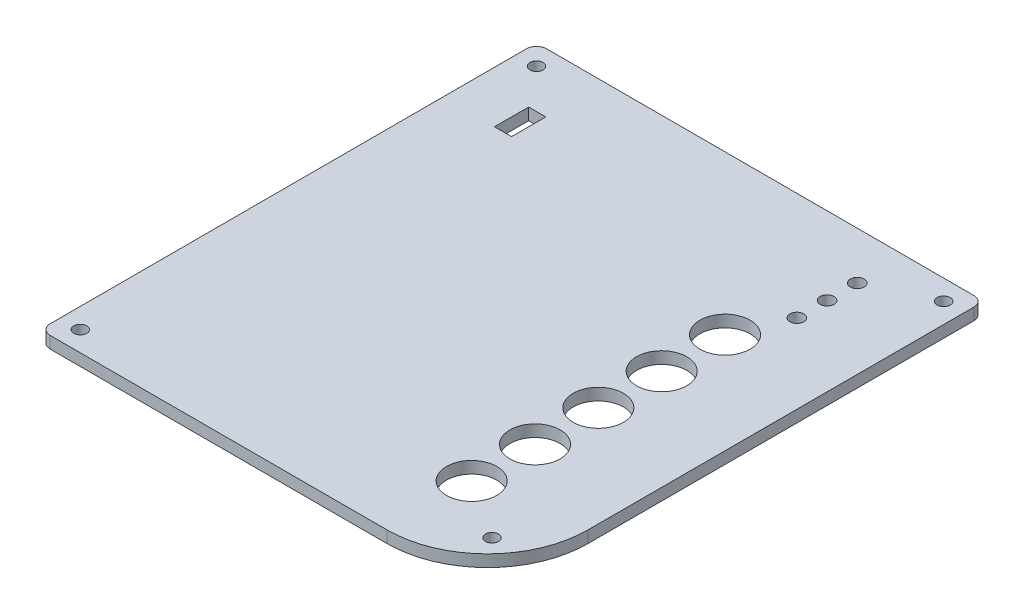
ISO-10303-21;
HEADER;
FILE_DESCRIPTION(('STEP AP214'),'2;1');
FILE_NAME('part.step','',(''),(''),'','','');
FILE_SCHEMA(('AUTOMOTIVE_DESIGN { 1 0 10303 214 1 1 1 1 }'));
ENDSEC;
DATA;
#1=APPLICATION_CONTEXT('core data for automotive mechanical design processes');
#2=APPLICATION_PROTOCOL_DEFINITION('international standard','automotive_design',2000,#1);
#3=PRODUCT_CONTEXT('',#1,'mechanical');
#4=PRODUCT('Part','Part','',(#3));
#5=PRODUCT_RELATED_PRODUCT_CATEGORY('part','',(#4));
#6=PRODUCT_DEFINITION_FORMATION('','',#4);
#7=PRODUCT_DEFINITION_CONTEXT('part definition',#1,'design');
#8=PRODUCT_DEFINITION('design','',#6,#7);
#9=PRODUCT_DEFINITION_SHAPE('','',#8);
#10=(LENGTH_UNIT() NAMED_UNIT(*) SI_UNIT(.MILLI.,.METRE.));
#11=(NAMED_UNIT(*) PLANE_ANGLE_UNIT() SI_UNIT($,.RADIAN.));
#12=(NAMED_UNIT(*) SI_UNIT($,.STERADIAN.) SOLID_ANGLE_UNIT());
#13=UNCERTAINTY_MEASURE_WITH_UNIT(LENGTH_MEASURE(1.E-05),#10,'distance_accuracy_value','');
#14=(GEOMETRIC_REPRESENTATION_CONTEXT(3) GLOBAL_UNCERTAINTY_ASSIGNED_CONTEXT((#13)) GLOBAL_UNIT_ASSIGNED_CONTEXT((#10,
#11,#12)) REPRESENTATION_CONTEXT('',''));
#15=CARTESIAN_POINT('',(0.,0.,0.));
#16=DIRECTION('',(0.,0.,1.));
#17=DIRECTION('',(1.,0.,0.));
#18=AXIS2_PLACEMENT_3D('',#15,#16,#17);
#19=CARTESIAN_POINT('',(22.8844907346791,3.,46.8900761871675));
#20=DIRECTION('',(0.,1.,0.));
#21=DIRECTION('',(0.,0.,1.));
#22=AXIS2_PLACEMENT_3D('',#19,#20,#21);
#23=PLANE('',#22);
#24=DIRECTION('',(0.,0.,1.));
#25=VECTOR('',#24,1.);
#26=CARTESIAN_POINT('',(-51.7155092653209,3.,-38.1099778128325));
#27=LINE('',#26,#25);
#28=CARTESIAN_POINT('',(-51.7155092653209,3.,-38.1099778128325));
#29=VERTEX_POINT('',#28);
#30=CARTESIAN_POINT('',(-51.7155092653209,3.,-29.4739778128325));
#31=VERTEX_POINT('',#30);
#32=EDGE_CURVE('E47',#29,#31,#27,.T.);
#33=ORIENTED_EDGE('',*,*,#32,.F.);
#34=DIRECTION('',(-1.,0.,0.));
#35=VECTOR('',#34,1.);
#36=CARTESIAN_POINT('',(-51.7155092653209,3.,-38.1099778128325));
#37=LINE('',#36,#35);
#38=CARTESIAN_POINT('',(-47.3975092653209,3.,-38.1099778128325));
#39=VERTEX_POINT('',#38);
#40=EDGE_CURVE('E139',#39,#29,#37,.T.);
#41=ORIENTED_EDGE('',*,*,#40,.F.);
#42=DIRECTION('',(0.,0.,-1.));
#43=VECTOR('',#42,1.);
#44=CARTESIAN_POINT('',(-47.3975092653209,3.,-38.1099778128325));
#45=LINE('',#44,#43);
#46=CARTESIAN_POINT('',(-47.3975092653209,3.,-29.4739778128325));
#47=VERTEX_POINT('',#46);
#48=EDGE_CURVE('E142',#47,#39,#45,.T.);
#49=ORIENTED_EDGE('',*,*,#48,.F.);
#50=DIRECTION('',(1.,0.,0.));
#51=VECTOR('',#50,1.);
#52=CARTESIAN_POINT('',(-51.7155092653209,3.,-29.4739778128325));
#53=LINE('',#52,#51);
#54=EDGE_CURVE('E148',#31,#47,#53,.T.);
#55=ORIENTED_EDGE('',*,*,#54,.F.);
#56=EDGE_LOOP('',(#33,#41,#49,#55));
#57=FACE_BOUND('',#56,.T.);
#58=CARTESIAN_POINT('',(28.2844907346793,3.,-25.8699778128325));
#59=DIRECTION('',(0.,1.,0.));
#60=DIRECTION('',(0.,0.,1.));
#61=AXIS2_PLACEMENT_3D('',#58,#59,#60);
#62=CIRCLE('',#61,1.75);
#63=CARTESIAN_POINT('',(28.2844907346793,3.,-24.1199778128325));
#64=VERTEX_POINT('',#63);
#65=EDGE_CURVE('E154',#64,#64,#62,.T.);
#66=ORIENTED_EDGE('',*,*,#65,.F.);
#67=EDGE_LOOP('',(#66));
#68=FACE_BOUND('',#67,.T.);
#69=CARTESIAN_POINT('',(28.2844907346792,3.,-33.4899778128325));
#70=DIRECTION('',(0.,1.,0.));
#71=DIRECTION('',(0.,0.,1.));
#72=AXIS2_PLACEMENT_3D('',#69,#70,#71);
#73=CIRCLE('',#72,1.75);
#74=CARTESIAN_POINT('',(28.2844907346792,3.,-31.7399778128325));
#75=VERTEX_POINT('',#74);
#76=EDGE_CURVE('E161',#75,#75,#73,.T.);
#77=ORIENTED_EDGE('',*,*,#76,.F.);
#78=EDGE_LOOP('',(#77));
#79=FACE_BOUND('',#78,.T.);
#80=CARTESIAN_POINT('',(28.2844907346791,3.,-41.1099778128325));
#81=DIRECTION('',(0.,1.,0.));
#82=DIRECTION('',(0.,0.,1.));
#83=AXIS2_PLACEMENT_3D('',#80,#81,#82);
#84=CIRCLE('',#83,1.75);
#85=CARTESIAN_POINT('',(28.2844907346791,3.,-39.3599778128325));
#86=VERTEX_POINT('',#85);
#87=EDGE_CURVE('E167',#86,#86,#84,.T.);
#88=ORIENTED_EDGE('',*,*,#87,.F.);
#89=EDGE_LOOP('',(#88));
#90=FACE_BOUND('',#89,.T.);
#91=CARTESIAN_POINT('',(22.8844907346798,3.,50.8900221871675));
#92=DIRECTION('',(0.,1.,0.));
#93=DIRECTION('',(0.,0.,1.));
#94=AXIS2_PLACEMENT_3D('',#91,#92,#93);
#95=CIRCLE('',#94,6.35);
#96=CARTESIAN_POINT('',(22.8844907346798,3.,57.2400221871675));
#97=VERTEX_POINT('',#96);
#98=EDGE_CURVE('E173',#97,#97,#95,.T.);
#99=ORIENTED_EDGE('',*,*,#98,.F.);
#100=EDGE_LOOP('',(#99));
#101=FACE_BOUND('',#100,.T.);
#102=CARTESIAN_POINT('',(22.8844907346796,3.,34.8900221871675));
#103=DIRECTION('',(0.,1.,0.));
#104=DIRECTION('',(0.,0.,1.));
#105=AXIS2_PLACEMENT_3D('',#102,#103,#104);
#106=CIRCLE('',#105,6.35);
#107=CARTESIAN_POINT('',(22.8844907346796,3.,41.2400221871675));
#108=VERTEX_POINT('',#107);
#109=EDGE_CURVE('E179',#108,#108,#106,.T.);
#110=ORIENTED_EDGE('',*,*,#109,.F.);
#111=EDGE_LOOP('',(#110));
#112=FACE_BOUND('',#111,.T.);
#113=CARTESIAN_POINT('',(22.8844907346794,3.,18.8900221871675));
#114=DIRECTION('',(0.,1.,0.));
#115=DIRECTION('',(0.,0.,1.));
#116=AXIS2_PLACEMENT_3D('',#113,#114,#115);
#117=CIRCLE('',#116,6.35);
#118=CARTESIAN_POINT('',(22.8844907346794,3.,25.2400221871675));
#119=VERTEX_POINT('',#118);
#120=EDGE_CURVE('E185',#119,#119,#117,.T.);
#121=ORIENTED_EDGE('',*,*,#120,.F.);
#122=EDGE_LOOP('',(#121));
#123=FACE_BOUND('',#122,.T.);
#124=CARTESIAN_POINT('',(22.8844907346793,3.,2.89002218716748));
#125=DIRECTION('',(0.,1.,0.));
#126=DIRECTION('',(0.,0.,1.));
#127=AXIS2_PLACEMENT_3D('',#124,#125,#126);
#128=CIRCLE('',#127,6.35);
#129=CARTESIAN_POINT('',(22.8844907346793,3.,9.24002218716748));
#130=VERTEX_POINT('',#129);
#131=EDGE_CURVE('E191',#130,#130,#128,.T.);
#132=ORIENTED_EDGE('',*,*,#131,.F.);
#133=EDGE_LOOP('',(#132));
#134=FACE_BOUND('',#133,.T.);
#135=CARTESIAN_POINT('',(22.8844907346791,3.,-13.1099778128325));
#136=DIRECTION('',(0.,1.,0.));
#137=DIRECTION('',(0.,0.,1.));
#138=AXIS2_PLACEMENT_3D('',#135,#136,#137);
#139=CIRCLE('',#138,6.35);
#140=CARTESIAN_POINT('',(22.8844907346791,3.,-6.75997781283252));
#141=VERTEX_POINT('',#140);
#142=EDGE_CURVE('E197',#141,#141,#139,.T.);
#143=ORIENTED_EDGE('',*,*,#142,.F.);
#144=EDGE_LOOP('',(#143));
#145=FACE_BOUND('',#144,.T.);
#146=CARTESIAN_POINT('',(-59.6555092853209,3.,67.2100761871675));
#147=DIRECTION('',(0.,1.,0.));
#148=DIRECTION('',(0.,0.,1.));
#149=AXIS2_PLACEMENT_3D('',#146,#147,#148);
#150=CIRCLE('',#149,1.65);
#151=CARTESIAN_POINT('',(-59.6555092853209,3.,68.8600761871675));
#152=VERTEX_POINT('',#151);
#153=EDGE_CURVE('E212',#152,#152,#150,.T.);
#154=ORIENTED_EDGE('',*,*,#153,.F.);
#155=EDGE_LOOP('',(#154));
#156=FACE_BOUND('',#155,.T.);
#157=CARTESIAN_POINT('',(-59.6555092853209,3.,-48.0299778128325));
#158=DIRECTION('',(0.,1.,0.));
#159=DIRECTION('',(0.,0.,1.));
#160=AXIS2_PLACEMENT_3D('',#157,#158,#159);
#161=CIRCLE('',#160,1.65);
#162=CARTESIAN_POINT('',(-59.6555092853209,3.,-46.3799778128325));
#163=VERTEX_POINT('',#162);
#164=EDGE_CURVE('E224',#163,#163,#161,.T.);
#165=ORIENTED_EDGE('',*,*,#164,.F.);
#166=EDGE_LOOP('',(#165));
#167=FACE_BOUND('',#166,.T.);
#168=DIRECTION('',(0.,0.,-1.));
#169=VECTOR('',#168,1.);
#170=CARTESIAN_POINT('',(48.2844907346791,3.,-53.1099778128325));
#171=LINE('',#170,#169);
#172=CARTESIAN_POINT('',(48.2844907346791,3.,46.8900761871675));
#173=VERTEX_POINT('',#172);
#174=CARTESIAN_POINT('',(48.2844907346791,3.,-50.5699778128325));
#175=VERTEX_POINT('',#174);
#176=EDGE_CURVE('E230',#173,#175,#171,.T.);
#177=ORIENTED_EDGE('',*,*,#176,.T.);
#178=CARTESIAN_POINT('',(45.7444907346791,3.,-50.5699778128325));
#179=DIRECTION('',(0.,1.,0.));
#180=DIRECTION('',(0.,0.,1.));
#181=AXIS2_PLACEMENT_3D('',#178,#179,#180);
#182=CIRCLE('',#181,2.54);
#183=CARTESIAN_POINT('',(45.7444907346791,3.,-53.1099778128325));
#184=VERTEX_POINT('',#183);
#185=EDGE_CURVE('E278',#175,#184,#182,.T.);
#186=ORIENTED_EDGE('',*,*,#185,.T.);
#187=DIRECTION('',(-1.,0.,0.));
#188=VECTOR('',#187,1.);
#189=CARTESIAN_POINT('',(48.2844907346791,3.,-53.1099778128325));
#190=LINE('',#189,#188);
#191=CARTESIAN_POINT('',(-62.1955092853209,3.,-53.1099778128325));
#192=VERTEX_POINT('',#191);
#193=EDGE_CURVE('E233',#184,#192,#190,.T.);
#194=ORIENTED_EDGE('',*,*,#193,.T.);
#195=CARTESIAN_POINT('',(-62.1955092853209,3.,-50.5699778128325));
#196=DIRECTION('',(0.,1.,0.));
#197=DIRECTION('',(0.,0.,1.));
#198=AXIS2_PLACEMENT_3D('',#195,#196,#197);
#199=CIRCLE('',#198,2.54);
#200=CARTESIAN_POINT('',(-64.7355092853209,3.,-50.5699778128325));
#201=VERTEX_POINT('',#200);
#202=EDGE_CURVE('E276',#192,#201,#199,.T.);
#203=ORIENTED_EDGE('',*,*,#202,.T.);
#204=DIRECTION('',(0.,0.,1.));
#205=VECTOR('',#204,1.);
#206=CARTESIAN_POINT('',(-64.7355092853209,3.,-53.1099778128325));
#207=LINE('',#206,#205);
#208=CARTESIAN_POINT('',(-64.7355092853209,3.,69.7500761871675));
#209=VERTEX_POINT('',#208);
#210=EDGE_CURVE('E237',#201,#209,#207,.T.);
#211=ORIENTED_EDGE('',*,*,#210,.T.);
#212=CARTESIAN_POINT('',(-62.1955092853209,3.,69.7500761871675));
#213=DIRECTION('',(0.,1.,0.));
#214=DIRECTION('',(0.,0.,1.));
#215=AXIS2_PLACEMENT_3D('',#212,#213,#214);
#216=CIRCLE('',#215,2.54);
#217=CARTESIAN_POINT('',(-62.1955092853209,3.,72.2900761871675));
#218=VERTEX_POINT('',#217);
#219=EDGE_CURVE('E274',#209,#218,#216,.T.);
#220=ORIENTED_EDGE('',*,*,#219,.T.);
#221=DIRECTION('',(1.,0.,0.));
#222=VECTOR('',#221,1.);
#223=CARTESIAN_POINT('',(22.8844907346791,3.,72.2900761871675));
#224=LINE('',#223,#222);
#225=CARTESIAN_POINT('',(22.8844907346791,3.,72.2900761871675));
#226=VERTEX_POINT('',#225);
#227=EDGE_CURVE('E240',#218,#226,#224,.T.);
#228=ORIENTED_EDGE('',*,*,#227,.T.);
#229=CARTESIAN_POINT('',(22.8844907346791,3.,46.8900761871675));
#230=DIRECTION('',(0.,1.,0.));
#231=DIRECTION('',(0.,0.,1.));
#232=AXIS2_PLACEMENT_3D('',#229,#230,#231);
#233=CIRCLE('',#232,25.4);
#234=EDGE_CURVE('E242',#226,#173,#233,.T.);
#235=ORIENTED_EDGE('',*,*,#234,.T.);
#236=EDGE_LOOP('',(#177,#186,#194,#203,#211,#220,#228,#235));
#237=FACE_BOUND('',#236,.T.);
#238=CARTESIAN_POINT('',(43.2044907346791,3.,-48.0299778128325));
#239=DIRECTION('',(0.,1.,0.));
#240=DIRECTION('',(0.,0.,1.));
#241=AXIS2_PLACEMENT_3D('',#238,#239,#240);
#242=CIRCLE('',#241,1.65);
#243=CARTESIAN_POINT('',(43.2044907346791,3.,-46.3799778128325));
#244=VERTEX_POINT('',#243);
#245=EDGE_CURVE('E218',#244,#244,#242,.T.);
#246=ORIENTED_EDGE('',*,*,#245,.F.);
#247=EDGE_LOOP('',(#246));
#248=FACE_BOUND('',#247,.T.);
#249=CARTESIAN_POINT('',(37.8808925712128,3.,60.7484791239135));
#250=DIRECTION('',(0.,1.,0.));
#251=DIRECTION('',(0.,0.,1.));
#252=AXIS2_PLACEMENT_3D('',#249,#250,#251);
#253=CIRCLE('',#252,1.65);
#254=CARTESIAN_POINT('',(37.8808925712128,3.,62.3984791239135));
#255=VERTEX_POINT('',#254);
#256=EDGE_CURVE('E206',#255,#255,#253,.T.);
#257=ORIENTED_EDGE('',*,*,#256,.F.);
#258=EDGE_LOOP('',(#257));
#259=FACE_BOUND('',#258,.T.);
#260=ADVANCED_FACE('F32',(#57,#68,#79,#90,#101,#112,#123,#134,#145,#156,#167,#237,#248,#259),
#23,.T.);
#261=CARTESIAN_POINT('',(22.8844907346791,0.,46.8900761871675));
#262=DIRECTION('',(0.,1.,0.));
#263=DIRECTION('',(0.,0.,1.));
#264=AXIS2_PLACEMENT_3D('',#261,#262,#263);
#265=PLANE('',#264);
#266=DIRECTION('',(-1.,0.,0.));
#267=VECTOR('',#266,1.);
#268=CARTESIAN_POINT('',(-51.7155092653209,0.,-38.1099778128325));
#269=LINE('',#268,#267);
#270=CARTESIAN_POINT('',(-47.3975092653209,0.,-38.1099778128325));
#271=VERTEX_POINT('',#270);
#272=CARTESIAN_POINT('',(-51.7155092653209,0.,-38.1099778128325));
#273=VERTEX_POINT('',#272);
#274=EDGE_CURVE('E129',#271,#273,#269,.T.);
#275=ORIENTED_EDGE('',*,*,#274,.T.);
#276=DIRECTION('',(0.,0.,1.));
#277=VECTOR('',#276,1.);
#278=CARTESIAN_POINT('',(-51.7155092653209,0.,-38.1099778128325));
#279=LINE('',#278,#277);
#280=CARTESIAN_POINT('',(-51.7155092653209,0.,-29.4739778128325));
#281=VERTEX_POINT('',#280);
#282=EDGE_CURVE('E123',#273,#281,#279,.T.);
#283=ORIENTED_EDGE('',*,*,#282,.T.);
#284=DIRECTION('',(1.,0.,0.));
#285=VECTOR('',#284,1.);
#286=CARTESIAN_POINT('',(-51.7155092653209,0.,-29.4739778128325));
#287=LINE('',#286,#285);
#288=CARTESIAN_POINT('',(-47.3975092653209,0.,-29.4739778128325));
#289=VERTEX_POINT('',#288);
#290=EDGE_CURVE('E132',#281,#289,#287,.T.);
#291=ORIENTED_EDGE('',*,*,#290,.T.);
#292=DIRECTION('',(0.,0.,-1.));
#293=VECTOR('',#292,1.);
#294=CARTESIAN_POINT('',(-47.3975092653209,0.,-38.1099778128325));
#295=LINE('',#294,#293);
#296=EDGE_CURVE('E55',#289,#271,#295,.T.);
#297=ORIENTED_EDGE('',*,*,#296,.T.);
#298=EDGE_LOOP('',(#275,#283,#291,#297));
#299=FACE_BOUND('',#298,.T.);
#300=CARTESIAN_POINT('',(28.2844907346793,0.,-25.8699778128325));
#301=DIRECTION('',(0.,1.,0.));
#302=DIRECTION('',(0.,0.,1.));
#303=AXIS2_PLACEMENT_3D('',#300,#301,#302);
#304=CIRCLE('',#303,1.75);
#305=CARTESIAN_POINT('',(28.2844907346793,0.,-24.1199778128325));
#306=VERTEX_POINT('',#305);
#307=EDGE_CURVE('E158',#306,#306,#304,.T.);
#308=ORIENTED_EDGE('',*,*,#307,.T.);
#309=EDGE_LOOP('',(#308));
#310=FACE_BOUND('',#309,.T.);
#311=CARTESIAN_POINT('',(28.2844907346792,0.,-33.4899778128325));
#312=DIRECTION('',(0.,1.,0.));
#313=DIRECTION('',(0.,0.,1.));
#314=AXIS2_PLACEMENT_3D('',#311,#312,#313);
#315=CIRCLE('',#314,1.75);
#316=CARTESIAN_POINT('',(28.2844907346792,0.,-31.7399778128325));
#317=VERTEX_POINT('',#316);
#318=EDGE_CURVE('E164',#317,#317,#315,.T.);
#319=ORIENTED_EDGE('',*,*,#318,.T.);
#320=EDGE_LOOP('',(#319));
#321=FACE_BOUND('',#320,.T.);
#322=CARTESIAN_POINT('',(28.2844907346791,0.,-41.1099778128325));
#323=DIRECTION('',(0.,1.,0.));
#324=DIRECTION('',(0.,0.,1.));
#325=AXIS2_PLACEMENT_3D('',#322,#323,#324);
#326=CIRCLE('',#325,1.75);
#327=CARTESIAN_POINT('',(28.2844907346791,0.,-39.3599778128325));
#328=VERTEX_POINT('',#327);
#329=EDGE_CURVE('E170',#328,#328,#326,.T.);
#330=ORIENTED_EDGE('',*,*,#329,.T.);
#331=EDGE_LOOP('',(#330));
#332=FACE_BOUND('',#331,.T.);
#333=CARTESIAN_POINT('',(22.8844907346798,0.,50.8900221871675));
#334=DIRECTION('',(0.,1.,0.));
#335=DIRECTION('',(0.,0.,1.));
#336=AXIS2_PLACEMENT_3D('',#333,#334,#335);
#337=CIRCLE('',#336,6.35);
#338=CARTESIAN_POINT('',(22.8844907346798,0.,57.2400221871675));
#339=VERTEX_POINT('',#338);
#340=EDGE_CURVE('E176',#339,#339,#337,.T.);
#341=ORIENTED_EDGE('',*,*,#340,.T.);
#342=EDGE_LOOP('',(#341));
#343=FACE_BOUND('',#342,.T.);
#344=CARTESIAN_POINT('',(22.8844907346796,0.,34.8900221871675));
#345=DIRECTION('',(0.,1.,0.));
#346=DIRECTION('',(0.,0.,1.));
#347=AXIS2_PLACEMENT_3D('',#344,#345,#346);
#348=CIRCLE('',#347,6.35);
#349=CARTESIAN_POINT('',(22.8844907346796,0.,41.2400221871675));
#350=VERTEX_POINT('',#349);
#351=EDGE_CURVE('E182',#350,#350,#348,.T.);
#352=ORIENTED_EDGE('',*,*,#351,.T.);
#353=EDGE_LOOP('',(#352));
#354=FACE_BOUND('',#353,.T.);
#355=CARTESIAN_POINT('',(22.8844907346794,0.,18.8900221871675));
#356=DIRECTION('',(0.,1.,0.));
#357=DIRECTION('',(0.,0.,1.));
#358=AXIS2_PLACEMENT_3D('',#355,#356,#357);
#359=CIRCLE('',#358,6.35);
#360=CARTESIAN_POINT('',(22.8844907346794,0.,25.2400221871675));
#361=VERTEX_POINT('',#360);
#362=EDGE_CURVE('E188',#361,#361,#359,.T.);
#363=ORIENTED_EDGE('',*,*,#362,.T.);
#364=EDGE_LOOP('',(#363));
#365=FACE_BOUND('',#364,.T.);
#366=CARTESIAN_POINT('',(22.8844907346793,0.,2.89002218716748));
#367=DIRECTION('',(0.,1.,0.));
#368=DIRECTION('',(0.,0.,1.));
#369=AXIS2_PLACEMENT_3D('',#366,#367,#368);
#370=CIRCLE('',#369,6.35);
#371=CARTESIAN_POINT('',(22.8844907346793,0.,9.24002218716748));
#372=VERTEX_POINT('',#371);
#373=EDGE_CURVE('E194',#372,#372,#370,.T.);
#374=ORIENTED_EDGE('',*,*,#373,.T.);
#375=EDGE_LOOP('',(#374));
#376=FACE_BOUND('',#375,.T.);
#377=CARTESIAN_POINT('',(22.8844907346791,0.,-13.1099778128325));
#378=DIRECTION('',(0.,1.,0.));
#379=DIRECTION('',(0.,0.,1.));
#380=AXIS2_PLACEMENT_3D('',#377,#378,#379);
#381=CIRCLE('',#380,6.35);
#382=CARTESIAN_POINT('',(22.8844907346791,0.,-6.75997781283252));
#383=VERTEX_POINT('',#382);
#384=EDGE_CURVE('E200',#383,#383,#381,.T.);
#385=ORIENTED_EDGE('',*,*,#384,.T.);
#386=EDGE_LOOP('',(#385));
#387=FACE_BOUND('',#386,.T.);
#388=CARTESIAN_POINT('',(-59.6555092853209,0.,67.2100761871675));
#389=DIRECTION('',(0.,1.,0.));
#390=DIRECTION('',(0.,0.,1.));
#391=AXIS2_PLACEMENT_3D('',#388,#389,#390);
#392=CIRCLE('',#391,1.65);
#393=CARTESIAN_POINT('',(-59.6555092853209,0.,68.8600761871675));
#394=VERTEX_POINT('',#393);
#395=EDGE_CURVE('E209',#394,#394,#392,.T.);
#396=ORIENTED_EDGE('',*,*,#395,.T.);
#397=EDGE_LOOP('',(#396));
#398=FACE_BOUND('',#397,.T.);
#399=CARTESIAN_POINT('',(-59.6555092853209,0.,-48.0299778128325));
#400=DIRECTION('',(0.,1.,0.));
#401=DIRECTION('',(0.,0.,1.));
#402=AXIS2_PLACEMENT_3D('',#399,#400,#401);
#403=CIRCLE('',#402,1.65);
#404=CARTESIAN_POINT('',(-59.6555092853209,0.,-46.3799778128325));
#405=VERTEX_POINT('',#404);
#406=EDGE_CURVE('E221',#405,#405,#403,.T.);
#407=ORIENTED_EDGE('',*,*,#406,.T.);
#408=EDGE_LOOP('',(#407));
#409=FACE_BOUND('',#408,.T.);
#410=DIRECTION('',(-1.,0.,0.));
#411=VECTOR('',#410,1.);
#412=CARTESIAN_POINT('',(48.2844907346791,0.,-53.1099778128325));
#413=LINE('',#412,#411);
#414=CARTESIAN_POINT('',(45.7444907346791,0.,-53.1099778128325));
#415=VERTEX_POINT('',#414);
#416=CARTESIAN_POINT('',(-62.1955092853209,0.,-53.1099778128325));
#417=VERTEX_POINT('',#416);
#418=EDGE_CURVE('E247',#415,#417,#413,.T.);
#419=ORIENTED_EDGE('',*,*,#418,.F.);
#420=CARTESIAN_POINT('',(45.7444907346791,0.,-50.5699778128325));
#421=DIRECTION('',(0.,1.,0.));
#422=DIRECTION('',(0.,0.,1.));
#423=AXIS2_PLACEMENT_3D('',#420,#421,#422);
#424=CIRCLE('',#423,2.54);
#425=CARTESIAN_POINT('',(48.2844907346791,0.,-50.5699778128325));
#426=VERTEX_POINT('',#425);
#427=EDGE_CURVE('E270',#415,#426,#424,.F.);
#428=ORIENTED_EDGE('',*,*,#427,.T.);
#429=DIRECTION('',(0.,0.,-1.));
#430=VECTOR('',#429,1.);
#431=CARTESIAN_POINT('',(48.2844907346791,0.,-53.1099778128325));
#432=LINE('',#431,#430);
#433=CARTESIAN_POINT('',(48.2844907346791,0.,46.8900761871675));
#434=VERTEX_POINT('',#433);
#435=EDGE_CURVE('E227',#434,#426,#432,.T.);
#436=ORIENTED_EDGE('',*,*,#435,.F.);
#437=CARTESIAN_POINT('',(22.8844907346791,0.,46.8900761871675));
#438=DIRECTION('',(0.,1.,0.));
#439=DIRECTION('',(0.,0.,1.));
#440=AXIS2_PLACEMENT_3D('',#437,#438,#439);
#441=CIRCLE('',#440,25.4);
#442=CARTESIAN_POINT('',(22.8844907346791,0.,72.2900761871675));
#443=VERTEX_POINT('',#442);
#444=EDGE_CURVE('E234',#443,#434,#441,.T.);
#445=ORIENTED_EDGE('',*,*,#444,.F.);
#446=DIRECTION('',(1.,0.,0.));
#447=VECTOR('',#446,1.);
#448=CARTESIAN_POINT('',(22.8844907346791,0.,72.2900761871675));
#449=LINE('',#448,#447);
#450=CARTESIAN_POINT('',(-62.1955092853209,0.,72.2900761871675));
#451=VERTEX_POINT('',#450);
#452=EDGE_CURVE('E253',#451,#443,#449,.T.);
#453=ORIENTED_EDGE('',*,*,#452,.F.);
#454=CARTESIAN_POINT('',(-62.1955092853209,0.,69.7500761871675));
#455=DIRECTION('',(0.,1.,0.));
#456=DIRECTION('',(0.,0.,1.));
#457=AXIS2_PLACEMENT_3D('',#454,#455,#456);
#458=CIRCLE('',#457,2.54);
#459=CARTESIAN_POINT('',(-64.7355092853209,0.,69.7500761871675));
#460=VERTEX_POINT('',#459);
#461=EDGE_CURVE('E266',#451,#460,#458,.F.);
#462=ORIENTED_EDGE('',*,*,#461,.T.);
#463=DIRECTION('',(0.,0.,1.));
#464=VECTOR('',#463,1.);
#465=CARTESIAN_POINT('',(-64.7355092853209,0.,-53.1099778128325));
#466=LINE('',#465,#464);
#467=CARTESIAN_POINT('',(-64.7355092853209,0.,-50.5699778128325));
#468=VERTEX_POINT('',#467);
#469=EDGE_CURVE('E250',#468,#460,#466,.T.);
#470=ORIENTED_EDGE('',*,*,#469,.F.);
#471=CARTESIAN_POINT('',(-62.1955092853209,0.,-50.5699778128325));
#472=DIRECTION('',(0.,1.,0.));
#473=DIRECTION('',(0.,0.,1.));
#474=AXIS2_PLACEMENT_3D('',#471,#472,#473);
#475=CIRCLE('',#474,2.54);
#476=EDGE_CURVE('E268',#468,#417,#475,.F.);
#477=ORIENTED_EDGE('',*,*,#476,.T.);
#478=EDGE_LOOP('',(#419,#428,#436,#445,#453,#462,#470,#477));
#479=FACE_BOUND('',#478,.T.);
#480=CARTESIAN_POINT('',(43.2044907346791,0.,-48.0299778128325));
#481=DIRECTION('',(0.,1.,0.));
#482=DIRECTION('',(0.,0.,1.));
#483=AXIS2_PLACEMENT_3D('',#480,#481,#482);
#484=CIRCLE('',#483,1.65);
#485=CARTESIAN_POINT('',(43.2044907346791,0.,-46.3799778128325));
#486=VERTEX_POINT('',#485);
#487=EDGE_CURVE('E215',#486,#486,#484,.T.);
#488=ORIENTED_EDGE('',*,*,#487,.T.);
#489=EDGE_LOOP('',(#488));
#490=FACE_BOUND('',#489,.T.);
#491=CARTESIAN_POINT('',(37.8808925712128,0.,60.7484791239135));
#492=DIRECTION('',(0.,1.,0.));
#493=DIRECTION('',(0.,0.,1.));
#494=AXIS2_PLACEMENT_3D('',#491,#492,#493);
#495=CIRCLE('',#494,1.65);
#496=CARTESIAN_POINT('',(37.8808925712128,0.,62.3984791239135));
#497=VERTEX_POINT('',#496);
#498=EDGE_CURVE('E203',#497,#497,#495,.T.);
#499=ORIENTED_EDGE('',*,*,#498,.T.);
#500=EDGE_LOOP('',(#499));
#501=FACE_BOUND('',#500,.T.);
#502=ADVANCED_FACE('F136',(#299,#310,#321,#332,#343,#354,#365,#376,#387,#398,#409,#479,#490,
#501),#265,.F.);
#503=CARTESIAN_POINT('',(48.2844907346791,3.,-53.1099778128325));
#504=DIRECTION('',(-1.,0.,0.));
#505=DIRECTION('',(0.,0.,1.));
#506=AXIS2_PLACEMENT_3D('',#503,#504,#505);
#507=PLANE('',#506);
#508=ORIENTED_EDGE('',*,*,#435,.T.);
#509=DIRECTION('',(0.,-1.,0.));
#510=VECTOR('',#509,1.);
#511=CARTESIAN_POINT('',(48.2844907346791,3.,-50.5699778128325));
#512=LINE('',#511,#510);
#513=EDGE_CURVE('E272',#426,#175,#512,.F.);
#514=ORIENTED_EDGE('',*,*,#513,.T.);
#515=ORIENTED_EDGE('',*,*,#176,.F.);
#516=DIRECTION('',(0.,-1.,0.));
#517=VECTOR('',#516,1.);
#518=CARTESIAN_POINT('',(48.2844907346791,3.,46.8900761871675));
#519=LINE('',#518,#517);
#520=EDGE_CURVE('E244',#173,#434,#519,.T.);
#521=ORIENTED_EDGE('',*,*,#520,.T.);
#522=EDGE_LOOP('',(#508,#514,#515,#521));
#523=FACE_BOUND('',#522,.T.);
#524=ADVANCED_FACE('F316',(#523),#507,.F.);
#525=CARTESIAN_POINT('',(48.2844907346791,3.,-53.1099778128325));
#526=DIRECTION('',(0.,0.,1.));
#527=DIRECTION('',(1.,0.,0.));
#528=AXIS2_PLACEMENT_3D('',#525,#526,#527);
#529=PLANE('',#528);
#530=ORIENTED_EDGE('',*,*,#193,.F.);
#531=DIRECTION('',(0.,-1.,0.));
#532=VECTOR('',#531,1.);
#533=CARTESIAN_POINT('',(45.7444907346791,3.,-53.1099778128325));
#534=LINE('',#533,#532);
#535=EDGE_CURVE('E263',#184,#415,#534,.T.);
#536=ORIENTED_EDGE('',*,*,#535,.T.);
#537=ORIENTED_EDGE('',*,*,#418,.T.);
#538=DIRECTION('',(0.,-1.,0.));
#539=VECTOR('',#538,1.);
#540=CARTESIAN_POINT('',(-62.1955092853209,3.,-53.1099778128325));
#541=LINE('',#540,#539);
#542=EDGE_CURVE('E261',#417,#192,#541,.F.);
#543=ORIENTED_EDGE('',*,*,#542,.T.);
#544=EDGE_LOOP('',(#530,#536,#537,#543));
#545=FACE_BOUND('',#544,.T.);
#546=ADVANCED_FACE('F310',(#545),#529,.F.);
#547=CARTESIAN_POINT('',(-64.7355092853209,3.,-53.1099778128325));
#548=DIRECTION('',(1.,0.,0.));
#549=DIRECTION('',(0.,0.,-1.));
#550=AXIS2_PLACEMENT_3D('',#547,#548,#549);
#551=PLANE('',#550);
#552=ORIENTED_EDGE('',*,*,#210,.F.);
#553=DIRECTION('',(0.,-1.,0.));
#554=VECTOR('',#553,1.);
#555=CARTESIAN_POINT('',(-64.7355092853209,3.,-50.5699778128325));
#556=LINE('',#555,#554);
#557=EDGE_CURVE('E40',#201,#468,#556,.T.);
#558=ORIENTED_EDGE('',*,*,#557,.T.);
#559=ORIENTED_EDGE('',*,*,#469,.T.);
#560=DIRECTION('',(0.,-1.,0.));
#561=VECTOR('',#560,1.);
#562=CARTESIAN_POINT('',(-64.7355092853209,3.,69.7500761871675));
#563=LINE('',#562,#561);
#564=EDGE_CURVE('E280',#460,#209,#563,.F.);
#565=ORIENTED_EDGE('',*,*,#564,.T.);
#566=EDGE_LOOP('',(#552,#558,#559,#565));
#567=FACE_BOUND('',#566,.T.);
#568=ADVANCED_FACE('F286',(#567),#551,.F.);
#569=CARTESIAN_POINT('',(22.8844907346791,3.,72.2900761871675));
#570=DIRECTION('',(0.,0.,-1.));
#571=DIRECTION('',(-1.,0.,0.));
#572=AXIS2_PLACEMENT_3D('',#569,#570,#571);
#573=PLANE('',#572);
#574=ORIENTED_EDGE('',*,*,#227,.F.);
#575=DIRECTION('',(0.,-1.,0.));
#576=VECTOR('',#575,1.);
#577=CARTESIAN_POINT('',(-62.1955092853209,3.,72.2900761871675));
#578=LINE('',#577,#576);
#579=EDGE_CURVE('E11',#218,#451,#578,.T.);
#580=ORIENTED_EDGE('',*,*,#579,.T.);
#581=ORIENTED_EDGE('',*,*,#452,.T.);
#582=DIRECTION('',(0.,-1.,0.));
#583=VECTOR('',#582,1.);
#584=CARTESIAN_POINT('',(22.8844907346791,3.,72.2900761871675));
#585=LINE('',#584,#583);
#586=EDGE_CURVE('E258',#226,#443,#585,.T.);
#587=ORIENTED_EDGE('',*,*,#586,.F.);
#588=EDGE_LOOP('',(#574,#580,#581,#587));
#589=FACE_BOUND('',#588,.T.);
#590=ADVANCED_FACE('F300',(#589),#573,.F.);
#591=CARTESIAN_POINT('',(22.8844907346791,3.,46.8900761871675));
#592=DIRECTION('',(0.,-1.,0.));
#593=DIRECTION('',(0.,0.,-1.));
#594=AXIS2_PLACEMENT_3D('',#591,#592,#593);
#595=CYLINDRICAL_SURFACE('',#594,25.4);
#596=ORIENTED_EDGE('',*,*,#444,.T.);
#597=ORIENTED_EDGE('',*,*,#520,.F.);
#598=ORIENTED_EDGE('',*,*,#234,.F.);
#599=ORIENTED_EDGE('',*,*,#586,.T.);
#600=EDGE_LOOP('',(#596,#597,#598,#599));
#601=FACE_BOUND('',#600,.T.);
#602=ADVANCED_FACE('F343',(#601),#595,.T.);
#603=CARTESIAN_POINT('',(-59.6555092853209,3.,-48.0299778128325));
#604=DIRECTION('',(0.,-1.,0.));
#605=DIRECTION('',(0.,0.,-1.));
#606=AXIS2_PLACEMENT_3D('',#603,#604,#605);
#607=CYLINDRICAL_SURFACE('',#606,1.65);
#608=ORIENTED_EDGE('',*,*,#164,.T.);
#609=EDGE_LOOP('',(#608));
#610=FACE_BOUND('',#609,.T.);
#611=ORIENTED_EDGE('',*,*,#406,.F.);
#612=EDGE_LOOP('',(#611));
#613=FACE_BOUND('',#612,.T.);
#614=ADVANCED_FACE('F340',(#610,#613),#607,.F.);
#615=CARTESIAN_POINT('',(43.2044907346791,3.,-48.0299778128325));
#616=DIRECTION('',(0.,-1.,0.));
#617=DIRECTION('',(0.,0.,-1.));
#618=AXIS2_PLACEMENT_3D('',#615,#616,#617);
#619=CYLINDRICAL_SURFACE('',#618,1.65);
#620=ORIENTED_EDGE('',*,*,#245,.T.);
#621=EDGE_LOOP('',(#620));
#622=FACE_BOUND('',#621,.T.);
#623=ORIENTED_EDGE('',*,*,#487,.F.);
#624=EDGE_LOOP('',(#623));
#625=FACE_BOUND('',#624,.T.);
#626=ADVANCED_FACE('F380',(#622,#625),#619,.F.);
#627=CARTESIAN_POINT('',(-59.6555092853209,3.,67.2100761871675));
#628=DIRECTION('',(0.,-1.,0.));
#629=DIRECTION('',(0.,0.,-1.));
#630=AXIS2_PLACEMENT_3D('',#627,#628,#629);
#631=CYLINDRICAL_SURFACE('',#630,1.65);
#632=ORIENTED_EDGE('',*,*,#153,.T.);
#633=EDGE_LOOP('',(#632));
#634=FACE_BOUND('',#633,.T.);
#635=ORIENTED_EDGE('',*,*,#395,.F.);
#636=EDGE_LOOP('',(#635));
#637=FACE_BOUND('',#636,.T.);
#638=ADVANCED_FACE('F327',(#634,#637),#631,.F.);
#639=CARTESIAN_POINT('',(37.8808925712128,3.,60.7484791239135));
#640=DIRECTION('',(0.,-1.,0.));
#641=DIRECTION('',(0.,0.,-1.));
#642=AXIS2_PLACEMENT_3D('',#639,#640,#641);
#643=CYLINDRICAL_SURFACE('',#642,1.65);
#644=ORIENTED_EDGE('',*,*,#256,.T.);
#645=EDGE_LOOP('',(#644));
#646=FACE_BOUND('',#645,.T.);
#647=ORIENTED_EDGE('',*,*,#498,.F.);
#648=EDGE_LOOP('',(#647));
#649=FACE_BOUND('',#648,.T.);
#650=ADVANCED_FACE('F321',(#646,#649),#643,.F.);
#651=CARTESIAN_POINT('',(45.7444907346791,3.,-50.5699778128325));
#652=DIRECTION('',(0.,-1.,0.));
#653=DIRECTION('',(0.,0.,-1.));
#654=AXIS2_PLACEMENT_3D('',#651,#652,#653);
#655=CYLINDRICAL_SURFACE('',#654,2.54);
#656=ORIENTED_EDGE('',*,*,#185,.F.);
#657=ORIENTED_EDGE('',*,*,#513,.F.);
#658=ORIENTED_EDGE('',*,*,#427,.F.);
#659=ORIENTED_EDGE('',*,*,#535,.F.);
#660=EDGE_LOOP('',(#656,#657,#658,#659));
#661=FACE_BOUND('',#660,.T.);
#662=ADVANCED_FACE('F319',(#661),#655,.T.);
#663=CARTESIAN_POINT('',(-62.1955092853209,3.,-50.5699778128325));
#664=DIRECTION('',(0.,-1.,0.));
#665=DIRECTION('',(0.,0.,-1.));
#666=AXIS2_PLACEMENT_3D('',#663,#664,#665);
#667=CYLINDRICAL_SURFACE('',#666,2.54);
#668=ORIENTED_EDGE('',*,*,#202,.F.);
#669=ORIENTED_EDGE('',*,*,#542,.F.);
#670=ORIENTED_EDGE('',*,*,#476,.F.);
#671=ORIENTED_EDGE('',*,*,#557,.F.);
#672=EDGE_LOOP('',(#668,#669,#670,#671));
#673=FACE_BOUND('',#672,.T.);
#674=ADVANCED_FACE('F308',(#673),#667,.T.);
#675=CARTESIAN_POINT('',(-62.1955092853209,3.,69.7500761871675));
#676=DIRECTION('',(0.,-1.,0.));
#677=DIRECTION('',(0.,0.,-1.));
#678=AXIS2_PLACEMENT_3D('',#675,#676,#677);
#679=CYLINDRICAL_SURFACE('',#678,2.54);
#680=ORIENTED_EDGE('',*,*,#219,.F.);
#681=ORIENTED_EDGE('',*,*,#564,.F.);
#682=ORIENTED_EDGE('',*,*,#461,.F.);
#683=ORIENTED_EDGE('',*,*,#579,.F.);
#684=EDGE_LOOP('',(#680,#681,#682,#683));
#685=FACE_BOUND('',#684,.T.);
#686=ADVANCED_FACE('F34',(#685),#679,.T.);
#687=CARTESIAN_POINT('',(22.8844907346791,0.,-13.1099778128325));
#688=DIRECTION('',(0.,1.,0.));
#689=DIRECTION('',(0.,0.,1.));
#690=AXIS2_PLACEMENT_3D('',#687,#688,#689);
#691=CYLINDRICAL_SURFACE('',#690,6.35);
#692=ORIENTED_EDGE('',*,*,#384,.F.);
#693=EDGE_LOOP('',(#692));
#694=FACE_BOUND('',#693,.T.);
#695=ORIENTED_EDGE('',*,*,#142,.T.);
#696=EDGE_LOOP('',(#695));
#697=FACE_BOUND('',#696,.T.);
#698=ADVANCED_FACE('F418',(#694,#697),#691,.F.);
#699=CARTESIAN_POINT('',(22.8844907346793,0.,2.89002218716748));
#700=DIRECTION('',(0.,1.,0.));
#701=DIRECTION('',(0.,0.,1.));
#702=AXIS2_PLACEMENT_3D('',#699,#700,#701);
#703=CYLINDRICAL_SURFACE('',#702,6.35);
#704=ORIENTED_EDGE('',*,*,#373,.F.);
#705=EDGE_LOOP('',(#704));
#706=FACE_BOUND('',#705,.T.);
#707=ORIENTED_EDGE('',*,*,#131,.T.);
#708=EDGE_LOOP('',(#707));
#709=FACE_BOUND('',#708,.T.);
#710=ADVANCED_FACE('F425',(#706,#709),#703,.F.);
#711=CARTESIAN_POINT('',(22.8844907346794,0.,18.8900221871675));
#712=DIRECTION('',(0.,1.,0.));
#713=DIRECTION('',(0.,0.,1.));
#714=AXIS2_PLACEMENT_3D('',#711,#712,#713);
#715=CYLINDRICAL_SURFACE('',#714,6.35);
#716=ORIENTED_EDGE('',*,*,#362,.F.);
#717=EDGE_LOOP('',(#716));
#718=FACE_BOUND('',#717,.T.);
#719=ORIENTED_EDGE('',*,*,#120,.T.);
#720=EDGE_LOOP('',(#719));
#721=FACE_BOUND('',#720,.T.);
#722=ADVANCED_FACE('F434',(#718,#721),#715,.F.);
#723=CARTESIAN_POINT('',(22.8844907346796,0.,34.8900221871675));
#724=DIRECTION('',(0.,1.,0.));
#725=DIRECTION('',(0.,0.,1.));
#726=AXIS2_PLACEMENT_3D('',#723,#724,#725);
#727=CYLINDRICAL_SURFACE('',#726,6.35);
#728=ORIENTED_EDGE('',*,*,#351,.F.);
#729=EDGE_LOOP('',(#728));
#730=FACE_BOUND('',#729,.T.);
#731=ORIENTED_EDGE('',*,*,#109,.T.);
#732=EDGE_LOOP('',(#731));
#733=FACE_BOUND('',#732,.T.);
#734=ADVANCED_FACE('F443',(#730,#733),#727,.F.);
#735=CARTESIAN_POINT('',(22.8844907346798,0.,50.8900221871675));
#736=DIRECTION('',(0.,1.,0.));
#737=DIRECTION('',(0.,0.,1.));
#738=AXIS2_PLACEMENT_3D('',#735,#736,#737);
#739=CYLINDRICAL_SURFACE('',#738,6.35);
#740=ORIENTED_EDGE('',*,*,#340,.F.);
#741=EDGE_LOOP('',(#740));
#742=FACE_BOUND('',#741,.T.);
#743=ORIENTED_EDGE('',*,*,#98,.T.);
#744=EDGE_LOOP('',(#743));
#745=FACE_BOUND('',#744,.T.);
#746=ADVANCED_FACE('F452',(#742,#745),#739,.F.);
#747=CARTESIAN_POINT('',(28.2844907346791,0.,-41.1099778128325));
#748=DIRECTION('',(0.,1.,0.));
#749=DIRECTION('',(0.,0.,1.));
#750=AXIS2_PLACEMENT_3D('',#747,#748,#749);
#751=CYLINDRICAL_SURFACE('',#750,1.75);
#752=ORIENTED_EDGE('',*,*,#329,.F.);
#753=EDGE_LOOP('',(#752));
#754=FACE_BOUND('',#753,.T.);
#755=ORIENTED_EDGE('',*,*,#87,.T.);
#756=EDGE_LOOP('',(#755));
#757=FACE_BOUND('',#756,.T.);
#758=ADVANCED_FACE('F461',(#754,#757),#751,.F.);
#759=CARTESIAN_POINT('',(28.2844907346792,0.,-33.4899778128325));
#760=DIRECTION('',(0.,1.,0.));
#761=DIRECTION('',(0.,0.,1.));
#762=AXIS2_PLACEMENT_3D('',#759,#760,#761);
#763=CYLINDRICAL_SURFACE('',#762,1.75);
#764=ORIENTED_EDGE('',*,*,#318,.F.);
#765=EDGE_LOOP('',(#764));
#766=FACE_BOUND('',#765,.T.);
#767=ORIENTED_EDGE('',*,*,#76,.T.);
#768=EDGE_LOOP('',(#767));
#769=FACE_BOUND('',#768,.T.);
#770=ADVANCED_FACE('F470',(#766,#769),#763,.F.);
#771=CARTESIAN_POINT('',(28.2844907346793,0.,-25.8699778128325));
#772=DIRECTION('',(0.,1.,0.));
#773=DIRECTION('',(0.,0.,1.));
#774=AXIS2_PLACEMENT_3D('',#771,#772,#773);
#775=CYLINDRICAL_SURFACE('',#774,1.75);
#776=ORIENTED_EDGE('',*,*,#307,.F.);
#777=EDGE_LOOP('',(#776));
#778=FACE_BOUND('',#777,.T.);
#779=ORIENTED_EDGE('',*,*,#65,.T.);
#780=EDGE_LOOP('',(#779));
#781=FACE_BOUND('',#780,.T.);
#782=ADVANCED_FACE('F479',(#778,#781),#775,.F.);
#783=CARTESIAN_POINT('',(-51.7155092653209,0.,-38.1099778128325));
#784=DIRECTION('',(-1.,0.,0.));
#785=DIRECTION('',(0.,0.,1.));
#786=AXIS2_PLACEMENT_3D('',#783,#784,#785);
#787=PLANE('',#786);
#788=ORIENTED_EDGE('',*,*,#32,.T.);
#789=DIRECTION('',(0.,1.,0.));
#790=VECTOR('',#789,1.);
#791=CARTESIAN_POINT('',(-51.7155092653209,0.,-29.4739778128325));
#792=LINE('',#791,#790);
#793=EDGE_CURVE('E119',#281,#31,#792,.T.);
#794=ORIENTED_EDGE('',*,*,#793,.F.);
#795=ORIENTED_EDGE('',*,*,#282,.F.);
#796=DIRECTION('',(0.,1.,0.));
#797=VECTOR('',#796,1.);
#798=CARTESIAN_POINT('',(-51.7155092653209,0.,-38.1099778128325));
#799=LINE('',#798,#797);
#800=EDGE_CURVE('E152',#273,#29,#799,.T.);
#801=ORIENTED_EDGE('',*,*,#800,.T.);
#802=EDGE_LOOP('',(#788,#794,#795,#801));
#803=FACE_BOUND('',#802,.T.);
#804=ADVANCED_FACE('F121',(#803),#787,.F.);
#805=CARTESIAN_POINT('',(-51.7155092653209,0.,-38.1099778128325));
#806=DIRECTION('',(0.,0.,-1.));
#807=DIRECTION('',(-1.,0.,0.));
#808=AXIS2_PLACEMENT_3D('',#805,#806,#807);
#809=PLANE('',#808);
#810=ORIENTED_EDGE('',*,*,#40,.T.);
#811=ORIENTED_EDGE('',*,*,#800,.F.);
#812=ORIENTED_EDGE('',*,*,#274,.F.);
#813=DIRECTION('',(0.,1.,0.));
#814=VECTOR('',#813,1.);
#815=CARTESIAN_POINT('',(-47.3975092653209,0.,-38.1099778128325));
#816=LINE('',#815,#814);
#817=EDGE_CURVE('E155',#271,#39,#816,.T.);
#818=ORIENTED_EDGE('',*,*,#817,.T.);
#819=EDGE_LOOP('',(#810,#811,#812,#818));
#820=FACE_BOUND('',#819,.T.);
#821=ADVANCED_FACE('F496',(#820),#809,.F.);
#822=CARTESIAN_POINT('',(-47.3975092653209,0.,-38.1099778128325));
#823=DIRECTION('',(1.,0.,0.));
#824=DIRECTION('',(0.,0.,-1.));
#825=AXIS2_PLACEMENT_3D('',#822,#823,#824);
#826=PLANE('',#825);
#827=ORIENTED_EDGE('',*,*,#48,.T.);
#828=ORIENTED_EDGE('',*,*,#817,.F.);
#829=ORIENTED_EDGE('',*,*,#296,.F.);
#830=DIRECTION('',(0.,1.,0.));
#831=VECTOR('',#830,1.);
#832=CARTESIAN_POINT('',(-47.3975092653209,0.,-29.4739778128325));
#833=LINE('',#832,#831);
#834=EDGE_CURVE('E128',#289,#47,#833,.T.);
#835=ORIENTED_EDGE('',*,*,#834,.T.);
#836=EDGE_LOOP('',(#827,#828,#829,#835));
#837=FACE_BOUND('',#836,.T.);
#838=ADVANCED_FACE('F504',(#837),#826,.F.);
#839=CARTESIAN_POINT('',(-51.7155092653209,0.,-29.4739778128325));
#840=DIRECTION('',(0.,0.,1.));
#841=DIRECTION('',(1.,0.,0.));
#842=AXIS2_PLACEMENT_3D('',#839,#840,#841);
#843=PLANE('',#842);
#844=ORIENTED_EDGE('',*,*,#54,.T.);
#845=ORIENTED_EDGE('',*,*,#834,.F.);
#846=ORIENTED_EDGE('',*,*,#290,.F.);
#847=ORIENTED_EDGE('',*,*,#793,.T.);
#848=EDGE_LOOP('',(#844,#845,#846,#847));
#849=FACE_BOUND('',#848,.T.);
#850=ADVANCED_FACE('F133',(#849),#843,.F.);
#851=CLOSED_SHELL('',(#260,#502,#524,#546,#568,#590,#602,#614,#626,#638,#650,#662,#674,#686,
#698,#710,#722,#734,#746,#758,#770,#782,#804,#821,#838,#850));
#852=MANIFOLD_SOLID_BREP('B2',#851);
#853=ADVANCED_BREP_SHAPE_REPRESENTATION('',(#18,#852),#14);
#854=SHAPE_DEFINITION_REPRESENTATION(#9,#853);
ENDSEC;
END-ISO-10303-21;
